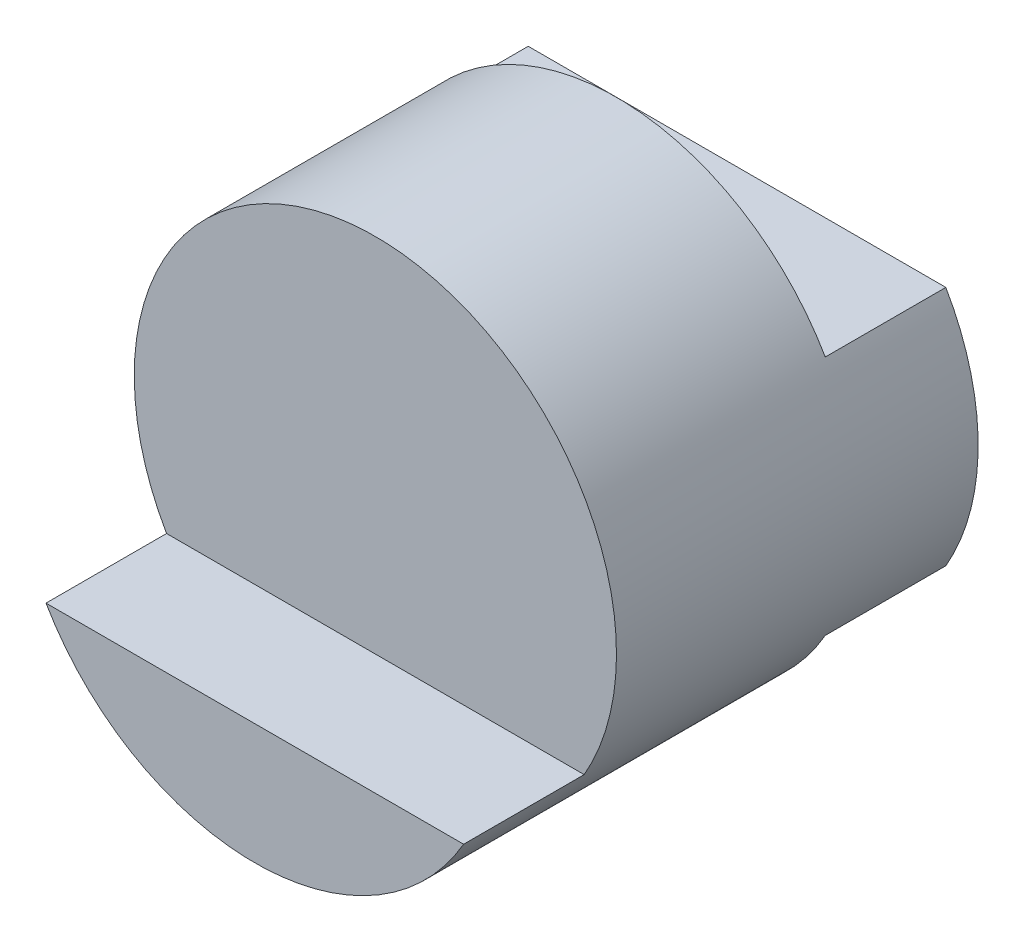
ISO-10303-21;
HEADER;
FILE_DESCRIPTION(('STEP AP214'),'2;1');
FILE_NAME('part.step','',(''),(''),'','','');
FILE_SCHEMA(('AUTOMOTIVE_DESIGN { 1 0 10303 214 1 1 1 1 }'));
ENDSEC;
DATA;
#1=APPLICATION_CONTEXT('core data for automotive mechanical design processes');
#2=APPLICATION_PROTOCOL_DEFINITION('international standard','automotive_design',2000,#1);
#3=PRODUCT_CONTEXT('',#1,'mechanical');
#4=PRODUCT('Part','Part','',(#3));
#5=PRODUCT_RELATED_PRODUCT_CATEGORY('part','',(#4));
#6=PRODUCT_DEFINITION_FORMATION('','',#4);
#7=PRODUCT_DEFINITION_CONTEXT('part definition',#1,'design');
#8=PRODUCT_DEFINITION('design','',#6,#7);
#9=PRODUCT_DEFINITION_SHAPE('','',#8);
#10=(LENGTH_UNIT() NAMED_UNIT(*) SI_UNIT(.MILLI.,.METRE.));
#11=(NAMED_UNIT(*) PLANE_ANGLE_UNIT() SI_UNIT($,.RADIAN.));
#12=(NAMED_UNIT(*) SI_UNIT($,.STERADIAN.) SOLID_ANGLE_UNIT());
#13=UNCERTAINTY_MEASURE_WITH_UNIT(LENGTH_MEASURE(1.E-05),#10,'distance_accuracy_value','');
#14=(GEOMETRIC_REPRESENTATION_CONTEXT(3) GLOBAL_UNCERTAINTY_ASSIGNED_CONTEXT((#13)) GLOBAL_UNIT_ASSIGNED_CONTEXT((#10,
#11,#12)) REPRESENTATION_CONTEXT('',''));
#15=CARTESIAN_POINT('',(0.,0.,0.));
#16=DIRECTION('',(0.,0.,1.));
#17=DIRECTION('',(1.,0.,0.));
#18=AXIS2_PLACEMENT_3D('',#15,#16,#17);
#19=CARTESIAN_POINT('',(0.,0.,3.));
#20=DIRECTION('',(0.,0.,-1.));
#21=DIRECTION('',(-1.,0.,0.));
#22=AXIS2_PLACEMENT_3D('',#19,#20,#21);
#23=CYLINDRICAL_SURFACE('',#22,2.);
#24=CARTESIAN_POINT('',(0.,0.,3.));
#25=DIRECTION('',(0.,0.,1.));
#26=DIRECTION('',(1.,0.,0.));
#27=AXIS2_PLACEMENT_3D('',#24,#25,#26);
#28=CIRCLE('',#27,2.);
#29=CARTESIAN_POINT('',(1.73205080756888,-1.,3.));
#30=VERTEX_POINT('',#29);
#31=CARTESIAN_POINT('',(-1.73205080756888,-1.,3.));
#32=VERTEX_POINT('',#31);
#33=EDGE_CURVE('E11',#30,#32,#28,.T.);
#34=ORIENTED_EDGE('',*,*,#33,.F.);
#35=DIRECTION('',(0.,0.,-1.));
#36=VECTOR('',#35,1.);
#37=CARTESIAN_POINT('',(1.73205080756888,-1.,4.));
#38=LINE('',#37,#36);
#39=CARTESIAN_POINT('',(1.73205080756888,-1.,4.));
#40=VERTEX_POINT('',#39);
#41=EDGE_CURVE('E124',#40,#30,#38,.T.);
#42=ORIENTED_EDGE('',*,*,#41,.F.);
#43=CARTESIAN_POINT('',(0.,0.,4.));
#44=DIRECTION('',(0.,0.,1.));
#45=DIRECTION('',(1.,0.,0.));
#46=AXIS2_PLACEMENT_3D('',#43,#44,#45);
#47=CIRCLE('',#46,2.);
#48=CARTESIAN_POINT('',(-1.73205080756888,-1.,4.));
#49=VERTEX_POINT('',#48);
#50=EDGE_CURVE('E114',#49,#40,#47,.T.);
#51=ORIENTED_EDGE('',*,*,#50,.F.);
#52=DIRECTION('',(0.,0.,-1.));
#53=VECTOR('',#52,1.);
#54=CARTESIAN_POINT('',(-1.73205080756888,-1.,4.));
#55=LINE('',#54,#53);
#56=EDGE_CURVE('E119',#49,#32,#55,.T.);
#57=ORIENTED_EDGE('',*,*,#56,.T.);
#58=EDGE_LOOP('',(#34,#42,#51,#57));
#59=FACE_BOUND('',#58,.T.);
#60=CARTESIAN_POINT('',(0.,0.,1.));
#61=DIRECTION('',(0.,0.,-1.));
#62=DIRECTION('',(1.,0.,0.));
#63=AXIS2_PLACEMENT_3D('',#60,#61,#62);
#64=CIRCLE('',#63,2.);
#65=CARTESIAN_POINT('',(1.73205080756888,-1.,1.));
#66=VERTEX_POINT('',#65);
#67=CARTESIAN_POINT('',(-1.73205080756888,-1.,1.));
#68=VERTEX_POINT('',#67);
#69=EDGE_CURVE('E87',#66,#68,#64,.T.);
#70=ORIENTED_EDGE('',*,*,#69,.F.);
#71=DIRECTION('',(0.,0.,-1.));
#72=VECTOR('',#71,1.);
#73=CARTESIAN_POINT('',(1.73205080756888,-1.,1.));
#74=LINE('',#73,#72);
#75=CARTESIAN_POINT('',(1.73205080756888,-1.,0.));
#76=VERTEX_POINT('',#75);
#77=EDGE_CURVE('E93',#66,#76,#74,.T.);
#78=ORIENTED_EDGE('',*,*,#77,.T.);
#79=CARTESIAN_POINT('',(0.,0.,0.));
#80=DIRECTION('',(0.,0.,1.));
#81=DIRECTION('',(1.,0.,0.));
#82=AXIS2_PLACEMENT_3D('',#79,#80,#81);
#83=CIRCLE('',#82,2.);
#84=CARTESIAN_POINT('',(1.73205080756888,1.,0.));
#85=VERTEX_POINT('',#84);
#86=EDGE_CURVE('E55',#76,#85,#83,.T.);
#87=ORIENTED_EDGE('',*,*,#86,.T.);
#88=DIRECTION('',(0.,0.,-1.));
#89=VECTOR('',#88,1.);
#90=CARTESIAN_POINT('',(1.73205080756888,1.,1.));
#91=LINE('',#90,#89);
#92=CARTESIAN_POINT('',(1.73205080756888,1.,1.));
#93=VERTEX_POINT('',#92);
#94=EDGE_CURVE('E108',#93,#85,#91,.T.);
#95=ORIENTED_EDGE('',*,*,#94,.F.);
#96=CARTESIAN_POINT('',(0.,0.,1.));
#97=DIRECTION('',(0.,0.,-1.));
#98=DIRECTION('',(-1.,0.,0.));
#99=AXIS2_PLACEMENT_3D('',#96,#97,#98);
#100=CIRCLE('',#99,2.);
#101=CARTESIAN_POINT('',(-1.73205080756888,1.,1.));
#102=VERTEX_POINT('',#101);
#103=EDGE_CURVE('E103',#102,#93,#100,.T.);
#104=ORIENTED_EDGE('',*,*,#103,.F.);
#105=DIRECTION('',(0.,0.,-1.));
#106=VECTOR('',#105,1.);
#107=CARTESIAN_POINT('',(-1.73205080756888,1.,1.));
#108=LINE('',#107,#106);
#109=CARTESIAN_POINT('',(-1.73205080756888,1.,0.));
#110=VERTEX_POINT('',#109);
#111=EDGE_CURVE('E110',#102,#110,#108,.T.);
#112=ORIENTED_EDGE('',*,*,#111,.T.);
#113=CARTESIAN_POINT('',(-1.73205080756888,-1.,0.));
#114=VERTEX_POINT('',#113);
#115=EDGE_CURVE('E36',#110,#114,#83,.T.);
#116=ORIENTED_EDGE('',*,*,#115,.T.);
#117=DIRECTION('',(0.,0.,-1.));
#118=VECTOR('',#117,1.);
#119=CARTESIAN_POINT('',(-1.73205080756888,-1.,1.));
#120=LINE('',#119,#118);
#121=EDGE_CURVE('E47',#68,#114,#120,.T.);
#122=ORIENTED_EDGE('',*,*,#121,.F.);
#123=EDGE_LOOP('',(#70,#78,#87,#95,#104,#112,#116,#122));
#124=FACE_BOUND('',#123,.T.);
#125=ADVANCED_FACE('F33',(#59,#124),#23,.T.);
#126=CARTESIAN_POINT('',(0.,0.,3.));
#127=DIRECTION('',(0.,0.,1.));
#128=DIRECTION('',(1.,0.,0.));
#129=AXIS2_PLACEMENT_3D('',#126,#127,#128);
#130=PLANE('',#129);
#131=DIRECTION('',(-1.,0.,0.));
#132=VECTOR('',#131,1.);
#133=CARTESIAN_POINT('',(-1.73205080756888,-1.,3.));
#134=LINE('',#133,#132);
#135=EDGE_CURVE('E112',#30,#32,#134,.T.);
#136=ORIENTED_EDGE('',*,*,#135,.F.);
#137=ORIENTED_EDGE('',*,*,#33,.T.);
#138=EDGE_LOOP('',(#136,#137));
#139=FACE_BOUND('',#138,.T.);
#140=ADVANCED_FACE('F134',(#139),#130,.T.);
#141=CARTESIAN_POINT('',(0.,0.,0.));
#142=DIRECTION('',(0.,0.,1.));
#143=DIRECTION('',(1.,0.,0.));
#144=AXIS2_PLACEMENT_3D('',#141,#142,#143);
#145=PLANE('',#144);
#146=ORIENTED_EDGE('',*,*,#86,.F.);
#147=DIRECTION('',(1.,0.,0.));
#148=VECTOR('',#147,1.);
#149=CARTESIAN_POINT('',(-1.73205080756888,-1.,0.));
#150=LINE('',#149,#148);
#151=EDGE_CURVE('E90',#114,#76,#150,.T.);
#152=ORIENTED_EDGE('',*,*,#151,.F.);
#153=ORIENTED_EDGE('',*,*,#115,.F.);
#154=DIRECTION('',(-1.,0.,0.));
#155=VECTOR('',#154,1.);
#156=CARTESIAN_POINT('',(-1.73205080756888,1.,0.));
#157=LINE('',#156,#155);
#158=EDGE_CURVE('E99',#85,#110,#157,.T.);
#159=ORIENTED_EDGE('',*,*,#158,.F.);
#160=EDGE_LOOP('',(#146,#152,#153,#159));
#161=FACE_BOUND('',#160,.T.);
#162=ADVANCED_FACE('F136',(#161),#145,.F.);
#163=CARTESIAN_POINT('',(-1.73205080756888,-1.,4.));
#164=DIRECTION('',(0.,-1.,0.));
#165=DIRECTION('',(0.,0.,-1.));
#166=AXIS2_PLACEMENT_3D('',#163,#164,#165);
#167=PLANE('',#166);
#168=ORIENTED_EDGE('',*,*,#135,.T.);
#169=ORIENTED_EDGE('',*,*,#56,.F.);
#170=DIRECTION('',(-1.,0.,0.));
#171=VECTOR('',#170,1.);
#172=CARTESIAN_POINT('',(-1.73205080756888,-1.,4.));
#173=LINE('',#172,#171);
#174=EDGE_CURVE('E117',#40,#49,#173,.T.);
#175=ORIENTED_EDGE('',*,*,#174,.F.);
#176=ORIENTED_EDGE('',*,*,#41,.T.);
#177=EDGE_LOOP('',(#168,#169,#175,#176));
#178=FACE_BOUND('',#177,.T.);
#179=ADVANCED_FACE('F128',(#178),#167,.F.);
#180=CARTESIAN_POINT('',(0.,0.,4.));
#181=DIRECTION('',(0.,0.,1.));
#182=DIRECTION('',(1.,0.,0.));
#183=AXIS2_PLACEMENT_3D('',#180,#181,#182);
#184=PLANE('',#183);
#185=ORIENTED_EDGE('',*,*,#50,.T.);
#186=ORIENTED_EDGE('',*,*,#174,.T.);
#187=EDGE_LOOP('',(#185,#186));
#188=FACE_BOUND('',#187,.T.);
#189=ADVANCED_FACE('F148',(#188),#184,.T.);
#190=CARTESIAN_POINT('',(-1.73205080756888,1.,1.));
#191=DIRECTION('',(0.,-1.,0.));
#192=DIRECTION('',(1.,0.,0.));
#193=AXIS2_PLACEMENT_3D('',#190,#191,#192);
#194=PLANE('',#193);
#195=ORIENTED_EDGE('',*,*,#158,.T.);
#196=ORIENTED_EDGE('',*,*,#111,.F.);
#197=DIRECTION('',(-1.,0.,0.));
#198=VECTOR('',#197,1.);
#199=CARTESIAN_POINT('',(-1.73205080756888,1.,1.));
#200=LINE('',#199,#198);
#201=EDGE_CURVE('E105',#93,#102,#200,.T.);
#202=ORIENTED_EDGE('',*,*,#201,.F.);
#203=ORIENTED_EDGE('',*,*,#94,.T.);
#204=EDGE_LOOP('',(#195,#196,#202,#203));
#205=FACE_BOUND('',#204,.T.);
#206=ADVANCED_FACE('F151',(#205),#194,.F.);
#207=CARTESIAN_POINT('',(0.,0.,1.));
#208=DIRECTION('',(0.,0.,-1.));
#209=DIRECTION('',(-1.,0.,0.));
#210=AXIS2_PLACEMENT_3D('',#207,#208,#209);
#211=PLANE('',#210);
#212=ORIENTED_EDGE('',*,*,#103,.T.);
#213=ORIENTED_EDGE('',*,*,#201,.T.);
#214=EDGE_LOOP('',(#212,#213));
#215=FACE_BOUND('',#214,.T.);
#216=ADVANCED_FACE('F155',(#215),#211,.T.);
#217=CARTESIAN_POINT('',(-1.73205080756888,-1.,1.));
#218=DIRECTION('',(0.,1.,0.));
#219=DIRECTION('',(0.,0.,1.));
#220=AXIS2_PLACEMENT_3D('',#217,#218,#219);
#221=PLANE('',#220);
#222=ORIENTED_EDGE('',*,*,#151,.T.);
#223=ORIENTED_EDGE('',*,*,#77,.F.);
#224=DIRECTION('',(1.,0.,0.));
#225=VECTOR('',#224,1.);
#226=CARTESIAN_POINT('',(-1.73205080756888,-1.,1.));
#227=LINE('',#226,#225);
#228=EDGE_CURVE('E89',#68,#66,#227,.T.);
#229=ORIENTED_EDGE('',*,*,#228,.F.);
#230=ORIENTED_EDGE('',*,*,#121,.T.);
#231=EDGE_LOOP('',(#222,#223,#229,#230));
#232=FACE_BOUND('',#231,.T.);
#233=ADVANCED_FACE('F92',(#232),#221,.F.);
#234=CARTESIAN_POINT('',(0.,0.,1.));
#235=DIRECTION('',(0.,0.,1.));
#236=DIRECTION('',(1.,0.,0.));
#237=AXIS2_PLACEMENT_3D('',#234,#235,#236);
#238=PLANE('',#237);
#239=ORIENTED_EDGE('',*,*,#69,.T.);
#240=ORIENTED_EDGE('',*,*,#228,.T.);
#241=EDGE_LOOP('',(#239,#240));
#242=FACE_BOUND('',#241,.T.);
#243=ADVANCED_FACE('F88',(#242),#238,.F.);
#244=CLOSED_SHELL('',(#125,#140,#162,#179,#189,#206,#216,#233,#243));
#245=MANIFOLD_SOLID_BREP('B2',#244);
#246=ADVANCED_BREP_SHAPE_REPRESENTATION('',(#18,#245),#14);
#247=SHAPE_DEFINITION_REPRESENTATION(#9,#246);
ENDSEC;
END-ISO-10303-21;
